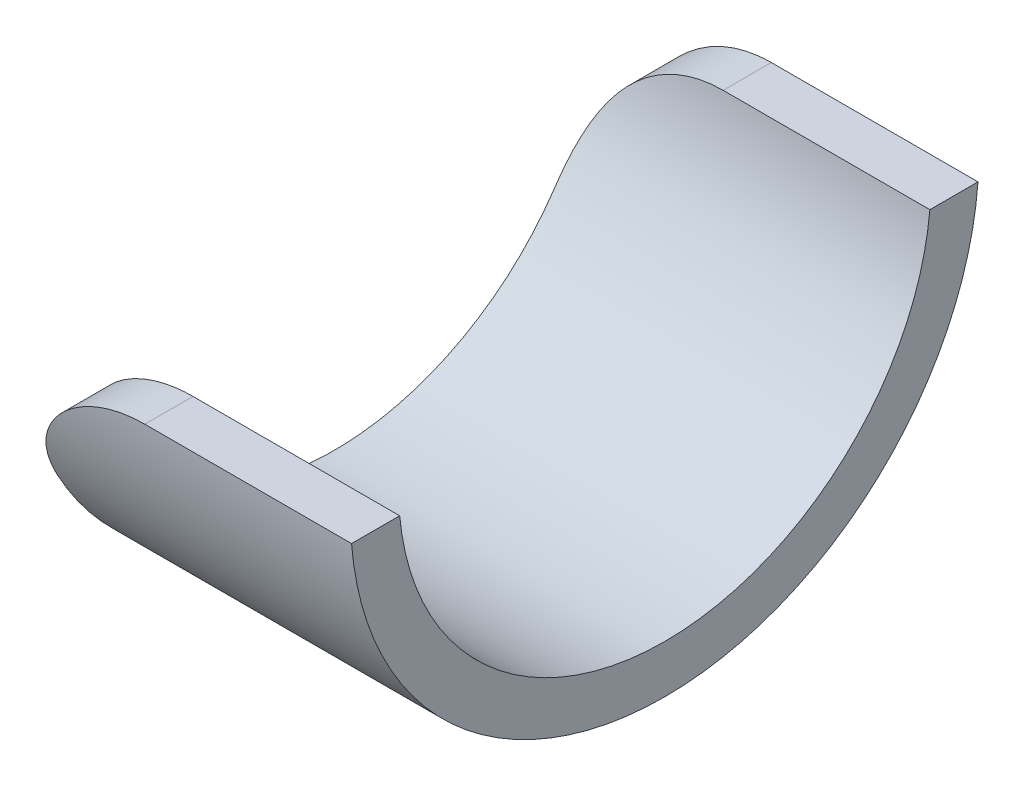
ISO-10303-21;
HEADER;
FILE_DESCRIPTION(('STEP AP214'),'2;1');
FILE_NAME('part.step','',(''),(''),'','','');
FILE_SCHEMA(('AUTOMOTIVE_DESIGN { 1 0 10303 214 1 1 1 1 }'));
ENDSEC;
DATA;
#1=APPLICATION_CONTEXT('core data for automotive mechanical design processes');
#2=APPLICATION_PROTOCOL_DEFINITION('international standard','automotive_design',2000,#1);
#3=PRODUCT_CONTEXT('',#1,'mechanical');
#4=PRODUCT('Part','Part','',(#3));
#5=PRODUCT_RELATED_PRODUCT_CATEGORY('part','',(#4));
#6=PRODUCT_DEFINITION_FORMATION('','',#4);
#7=PRODUCT_DEFINITION_CONTEXT('part definition',#1,'design');
#8=PRODUCT_DEFINITION('design','',#6,#7);
#9=PRODUCT_DEFINITION_SHAPE('','',#8);
#10=(LENGTH_UNIT() NAMED_UNIT(*) SI_UNIT(.MILLI.,.METRE.));
#11=(NAMED_UNIT(*) PLANE_ANGLE_UNIT() SI_UNIT($,.RADIAN.));
#12=(NAMED_UNIT(*) SI_UNIT($,.STERADIAN.) SOLID_ANGLE_UNIT());
#13=UNCERTAINTY_MEASURE_WITH_UNIT(LENGTH_MEASURE(1.E-05),#10,'distance_accuracy_value','');
#14=(GEOMETRIC_REPRESENTATION_CONTEXT(3) GLOBAL_UNCERTAINTY_ASSIGNED_CONTEXT((#13)) GLOBAL_UNIT_ASSIGNED_CONTEXT((#10,
#11,#12)) REPRESENTATION_CONTEXT('',''));
#15=CARTESIAN_POINT('',(0.,0.,0.));
#16=DIRECTION('',(0.,0.,1.));
#17=DIRECTION('',(1.,0.,0.));
#18=AXIS2_PLACEMENT_3D('',#15,#16,#17);
#19=CARTESIAN_POINT('',(25.4,0.,0.));
#20=DIRECTION('',(-1.,0.,0.));
#21=DIRECTION('',(0.,0.,1.));
#22=AXIS2_PLACEMENT_3D('',#19,#20,#21);
#23=CYLINDRICAL_SURFACE('',#22,24.13);
#24=CARTESIAN_POINT('',(0.,0.,0.));
#25=DIRECTION('',(1.,0.,0.));
#26=DIRECTION('',(0.,0.,-1.));
#27=AXIS2_PLACEMENT_3D('',#24,#25,#26);
#28=CIRCLE('',#27,24.13);
#29=CARTESIAN_POINT('',(0.,-11.43,21.2511646739655));
#30=VERTEX_POINT('',#29);
#31=CARTESIAN_POINT('',(0.,-11.43,-21.2511646739655));
#32=VERTEX_POINT('',#31);
#33=EDGE_CURVE('E164',#30,#32,#28,.T.);
#34=ORIENTED_EDGE('',*,*,#33,.T.);
#35=CARTESIAN_POINT('',(0.,-11.43,-21.2511646739655));
#36=CARTESIAN_POINT('',(-2.62243007126413E-05,-11.1860224640543,-21.3824335393108));
#37=CARTESIAN_POINT('',(0.00937477308694025,-10.9396845502003,-21.5094658719944));
#38=CARTESIAN_POINT('',(0.0479236395877504,-10.4439055163118,-21.7544876609394));
#39=CARTESIAN_POINT('',(0.0770830725086785,-10.1944626630503,-21.8724717766096));
#40=CARTESIAN_POINT('',(0.156118837118842,-9.69390311880306,-22.0988883031836));
#41=CARTESIAN_POINT('',(0.206034677985443,-9.44278413916173,-22.2073020174487));
#42=CARTESIAN_POINT('',(0.327202368802155,-8.94150477192952,-22.4138311063666));
#43=CARTESIAN_POINT('',(0.398449861662112,-8.69134419913753,-22.5119485785534));
#44=CARTESIAN_POINT('',(0.562964102877934,-8.19324315777415,-22.6979873973509));
#45=CARTESIAN_POINT('',(0.656316560719896,-7.94531533145705,-22.7858670176028));
#46=CARTESIAN_POINT('',(0.864917743170024,-7.45513554205446,-22.9509202864259));
#47=CARTESIAN_POINT('',(0.980168085088761,-7.21288399968737,-23.0280931434996));
#48=CARTESIAN_POINT('',(1.23201910546764,-6.73697795539725,-23.1717872843801));
#49=CARTESIAN_POINT('',(1.36858542185224,-6.50331035205277,-23.238325368346));
#50=CARTESIAN_POINT('',(1.66250238886438,-6.04664831564512,-23.3613112980713));
#51=CARTESIAN_POINT('',(1.81985155894157,-5.82365312382992,-23.4177598619249));
#52=CARTESIAN_POINT('',(2.14347109553134,-5.40470991060296,-23.5178520749754));
#53=CARTESIAN_POINT('',(2.3085037041298,-5.20794553211169,-23.562088255933));
#54=CARTESIAN_POINT('',(2.65479050631666,-4.82757709066209,-23.6429526368408));
#55=CARTESIAN_POINT('',(2.83604409448118,-4.64397253699317,-23.6795811205675));
#56=CARTESIAN_POINT('',(3.21363852043108,-4.29143598197451,-23.7460034791518));
#57=CARTESIAN_POINT('',(3.40998739998141,-4.12251190492314,-23.7757936768714));
#58=CARTESIAN_POINT('',(3.81630838261891,-3.80087139049984,-23.8293278664702));
#59=CARTESIAN_POINT('',(4.02628051460483,-3.64815498751076,-23.8530718455232));
#60=CARTESIAN_POINT('',(4.45704285565434,-3.36104542848596,-23.895213047223));
#61=CARTESIAN_POINT('',(4.67775947309696,-3.22654644377813,-23.9136419215247));
#62=CARTESIAN_POINT('',(5.12964311440567,-2.97581587645182,-23.9461355713094));
#63=CARTESIAN_POINT('',(5.36081023917931,-2.85958447026916,-23.960200304643));
#64=CARTESIAN_POINT('',(5.831928095831,-2.64628232956131,-23.9846954693647));
#65=CARTESIAN_POINT('',(6.07187653555342,-2.54920663658397,-23.9951268417838));
#66=CARTESIAN_POINT('',(6.55895637291033,-2.37488541721316,-24.0130070257699));
#67=CARTESIAN_POINT('',(6.80608684064031,-2.29763733623003,-24.0204562216298));
#68=CARTESIAN_POINT('',(7.25703859547032,-2.17660389124137,-24.0316919659944));
#69=CARTESIAN_POINT('',(7.45989511606065,-2.12922984902613,-24.0359096588211));
#70=CARTESIAN_POINT('',(7.86827969905803,-2.04787644322711,-24.0429774229925));
#71=CARTESIAN_POINT('',(8.07380739515986,-2.0138952626542,-24.0458276798666));
#72=CARTESIAN_POINT('',(8.48648285909893,-1.95949981658252,-24.0503232209338));
#73=CARTESIAN_POINT('',(8.69362909932989,-1.93907402968682,-24.0519695285443));
#74=CARTESIAN_POINT('',(9.10884950593469,-1.9118178800914,-24.0541447550348));
#75=CARTESIAN_POINT('',(9.31692380045259,-1.90498945704754,-24.0546735144979));
#76=CARTESIAN_POINT('',(9.525,-1.905,-24.0546850945923));
#77=B_SPLINE_CURVE_WITH_KNOTS('',3,(#35,#36,#37,#38,#39,#40,#41,#42,#43,#44,#45,#46,#47,#48,#49,
#50,#51,#52,#53,#54,#55,#56,#57,#58,#59,#60,#61,#62,#63,#64,#65,#66,#67,#68,#69,#70,#71,#72,#73,
#74,#75,#76),.UNSPECIFIED.,.F.,.F.,(4,2,2,2,2,2,2,2,2,2,2,2,2,2,2,2,2,2,2,2,4),(0.,
0.831053790770307,1.66259438406464,2.49572508742816,3.32868573588827,4.16493056434458,
5.0012371793046,5.83620930417523,6.67112197849129,7.45196225401338,8.23277339798149,
9.01400342752858,9.79523511433871,10.5717136526312,11.3481996900133,12.1244844697337,
12.9006691826562,13.5253091224103,14.1498642890198,14.7738879332271,15.3980005876607),.UNSPECIFIED.);
#78=CARTESIAN_POINT('',(9.525,-1.905,-24.0546850945923));
#79=VERTEX_POINT('',#78);
#80=EDGE_CURVE('E42',#32,#79,#77,.T.);
#81=ORIENTED_EDGE('',*,*,#80,.T.);
#82=DIRECTION('',(-1.,0.,0.));
#83=VECTOR('',#82,1.);
#84=CARTESIAN_POINT('',(25.4,-1.905,-24.0546850945923));
#85=LINE('',#84,#83);
#86=CARTESIAN_POINT('',(25.4,-1.905,-24.0546850945923));
#87=VERTEX_POINT('',#86);
#88=EDGE_CURVE('E94',#87,#79,#85,.T.);
#89=ORIENTED_EDGE('',*,*,#88,.F.);
#90=CARTESIAN_POINT('',(25.4,0.,0.));
#91=DIRECTION('',(1.,0.,0.));
#92=DIRECTION('',(0.,0.,-1.));
#93=AXIS2_PLACEMENT_3D('',#90,#91,#92);
#94=CIRCLE('',#93,24.13);
#95=CARTESIAN_POINT('',(25.4,-1.905,24.0546850945923));
#96=VERTEX_POINT('',#95);
#97=EDGE_CURVE('E101',#96,#87,#94,.T.);
#98=ORIENTED_EDGE('',*,*,#97,.F.);
#99=DIRECTION('',(-1.,0.,0.));
#100=VECTOR('',#99,1.);
#101=CARTESIAN_POINT('',(25.4,-1.905,24.0546850945923));
#102=LINE('',#101,#100);
#103=CARTESIAN_POINT('',(9.525,-1.905,24.0546850945923));
#104=VERTEX_POINT('',#103);
#105=EDGE_CURVE('E183',#96,#104,#102,.T.);
#106=ORIENTED_EDGE('',*,*,#105,.T.);
#107=CARTESIAN_POINT('',(9.525,-1.905,24.0546850945923));
#108=CARTESIAN_POINT('',(9.25902855860662,-1.90497112249098,24.0546543706783));
#109=CARTESIAN_POINT('',(8.99305996792605,-1.91613908815105,24.0538018907344));
#110=CARTESIAN_POINT('',(8.46300387273561,-1.9606612994031,24.0502314004206));
#111=CARTESIAN_POINT('',(8.1989163303127,-1.99401509654734,24.0475134277582));
#112=CARTESIAN_POINT('',(7.67456650786336,-2.08268810274374,24.0399910936523));
#113=CARTESIAN_POINT('',(7.41430308962371,-2.1380006327919,24.0351873665735));
#114=CARTESIAN_POINT('',(6.89937138401652,-2.2701777631287,24.0230644040504));
#115=CARTESIAN_POINT('',(6.6447029998715,-2.34704199031998,24.0157452121526));
#116=CARTESIAN_POINT('',(6.14260206552165,-2.52181707329971,23.9980216823762));
#117=CARTESIAN_POINT('',(5.89517469334633,-2.61974259140439,23.9876151932781));
#118=CARTESIAN_POINT('',(5.40953230749561,-2.83586324053376,23.9630257307452));
#119=CARTESIAN_POINT('',(5.17131717562001,-2.9540581113811,23.9488428057835));
#120=CARTESIAN_POINT('',(4.70588661033124,-3.20976539159897,23.9159133288637));
#121=CARTESIAN_POINT('',(4.47866874681592,-3.34727350681213,23.8971677906916));
#122=CARTESIAN_POINT('',(4.03685190596719,-3.64051036300694,23.8542560267361));
#123=CARTESIAN_POINT('',(3.82225273297257,-3.79623882135804,23.8300898850306));
#124=CARTESIAN_POINT('',(3.40913310360506,-4.12311644738061,23.7757019327644));
#125=CARTESIAN_POINT('',(3.21048485846543,-4.29411352349554,23.7455368268045));
#126=CARTESIAN_POINT('',(2.82856447170116,-4.65123007876344,23.6781748356056));
#127=CARTESIAN_POINT('',(2.64529225956836,-4.8373494885639,23.6409779826139));
#128=CARTESIAN_POINT('',(2.29548581756171,-5.22294907941939,23.5587888909164));
#129=CARTESIAN_POINT('',(2.12894399446347,-5.42242313023072,23.5138002140805));
#130=CARTESIAN_POINT('',(1.81359856584554,-5.83295582002549,23.4153383321293));
#131=CARTESIAN_POINT('',(1.6647945124326,-6.04401416629933,23.3618653413296));
#132=CARTESIAN_POINT('',(1.38874855215797,-6.47113711214399,23.2471317644862));
#133=CARTESIAN_POINT('',(1.26111596507832,-6.68700031712436,23.1860605993367));
#134=CARTESIAN_POINT('',(1.02423098390503,-7.12596104699,23.0549352631465));
#135=CARTESIAN_POINT('',(0.914978750332491,-7.34905863503499,22.9848810136632));
#136=CARTESIAN_POINT('',(0.715071957252479,-7.80069709441672,22.8355565811858));
#137=CARTESIAN_POINT('',(0.624434549431874,-8.02924277118396,22.7562780033086));
#138=CARTESIAN_POINT('',(0.461930113313286,-8.48959759740636,22.5885730040502));
#139=CARTESIAN_POINT('',(0.390061506300686,-8.72140647065202,22.5001473529379));
#140=CARTESIAN_POINT('',(0.271603413772416,-9.16141574281794,22.3243212812767));
#141=CARTESIAN_POINT('',(0.223127464472969,-9.36947657204716,22.2378315842086));
#142=CARTESIAN_POINT('',(0.140643449883782,-9.7854805725289,22.0579381550127));
#143=CARTESIAN_POINT('',(0.106635777848727,-9.99342374042991,21.9645342350342));
#144=CARTESIAN_POINT('',(0.0527401220690146,-10.4075477143405,21.771354509249));
#145=CARTESIAN_POINT('',(0.0328187663108996,-10.6137315346706,21.6715943779708));
#146=CARTESIAN_POINT('',(0.00644491721495352,-11.0238100019182,21.4659113001518));
#147=CARTESIAN_POINT('',(-1.12453408408947E-05,-11.2277052573949,21.3599900405856));
#148=CARTESIAN_POINT('',(0.,-11.43,21.2511646739655));
#149=B_SPLINE_CURVE_WITH_KNOTS('',3,(#107,#108,#109,#110,#111,#112,#113,#114,#115,#116,#117,
#118,#119,#120,#121,#122,#123,#124,#125,#126,#127,#128,#129,#130,#131,#132,#133,#134,#135,#136,
#137,#138,#139,#140,#141,#142,#143,#144,#145,#146,#147,#148),.UNSPECIFIED.,.F.,.F.,(4,2,2,2,2,2,
2,2,2,2,2,2,2,2,2,2,2,2,2,2,4),(0.,0.797674807200183,1.59533349129078,2.39274974387176,
3.19015219264293,3.98811157936095,4.78606072424157,5.58383273105668,6.38159236462163,
7.17214191497642,7.96268783999794,8.75287333268876,9.54303886831846,10.316430031771,
11.0898279491281,11.8639353089751,12.6379775347455,13.3288503903548,14.0197420230188,
14.7089913240004,15.3980527824104),.UNSPECIFIED.);
#150=EDGE_CURVE('E49',#104,#30,#149,.T.);
#151=ORIENTED_EDGE('',*,*,#150,.T.);
#152=EDGE_LOOP('',(#34,#81,#89,#98,#106,#151));
#153=FACE_BOUND('',#152,.T.);
#154=ADVANCED_FACE('F33',(#153),#23,.T.);
#155=CARTESIAN_POINT('',(25.4,-1.905,-20.3580643480661));
#156=DIRECTION('',(0.,-1.,0.));
#157=DIRECTION('',(0.,0.,-1.));
#158=AXIS2_PLACEMENT_3D('',#155,#156,#157);
#159=PLANE('',#158);
#160=ORIENTED_EDGE('',*,*,#88,.T.);
#161=DIRECTION('',(0.,0.,1.));
#162=VECTOR('',#161,1.);
#163=CARTESIAN_POINT('',(9.525,-1.905,-20.3580643480661));
#164=LINE('',#163,#162);
#165=CARTESIAN_POINT('',(9.525,-1.905,-20.3580643480661));
#166=VERTEX_POINT('',#165);
#167=EDGE_CURVE('E113',#79,#166,#164,.T.);
#168=ORIENTED_EDGE('',*,*,#167,.T.);
#169=DIRECTION('',(-1.,0.,0.));
#170=VECTOR('',#169,1.);
#171=CARTESIAN_POINT('',(25.4,-1.905,-20.3580643480661));
#172=LINE('',#171,#170);
#173=CARTESIAN_POINT('',(25.4,-1.905,-20.3580643480661));
#174=VERTEX_POINT('',#173);
#175=EDGE_CURVE('E97',#174,#166,#172,.T.);
#176=ORIENTED_EDGE('',*,*,#175,.F.);
#177=DIRECTION('',(0.,0.,1.));
#178=VECTOR('',#177,1.);
#179=CARTESIAN_POINT('',(25.4,-1.905,-20.3580643480661));
#180=LINE('',#179,#178);
#181=EDGE_CURVE('E89',#87,#174,#180,.T.);
#182=ORIENTED_EDGE('',*,*,#181,.F.);
#183=EDGE_LOOP('',(#160,#168,#176,#182));
#184=FACE_BOUND('',#183,.T.);
#185=ADVANCED_FACE('F91',(#184),#159,.F.);
#186=CARTESIAN_POINT('',(25.4,0.,0.));
#187=DIRECTION('',(-1.,0.,0.));
#188=DIRECTION('',(0.,0.,1.));
#189=AXIS2_PLACEMENT_3D('',#186,#187,#188);
#190=CYLINDRICAL_SURFACE('',#189,20.447);
#191=ORIENTED_EDGE('',*,*,#175,.T.);
#192=CARTESIAN_POINT('',(9.525,-1.905,-20.3580643480661));
#193=CARTESIAN_POINT('',(9.25978977014526,-1.90497110377044,-20.3580283743182));
#194=CARTESIAN_POINT('',(8.99458190205295,-1.91607541741178,-20.3570267347558));
#195=CARTESIAN_POINT('',(8.46603330595991,-1.96034336128463,-20.352832188804));
#196=CARTESIAN_POINT('',(8.20269256023756,-1.99350678186011,-20.3496393032408));
#197=CARTESIAN_POINT('',(7.67976710818044,-2.08168051639916,-20.3408028731761));
#198=CARTESIAN_POINT('',(7.42018195184562,-2.13668819010333,-20.3351596248361));
#199=CARTESIAN_POINT('',(6.9065823565463,-2.26813517562933,-20.3209194671558));
#200=CARTESIAN_POINT('',(6.65256781040154,-2.34457407471702,-20.312322614697));
#201=CARTESIAN_POINT('',(6.15172905872527,-2.51837915517059,-20.2915062917797));
#202=CARTESIAN_POINT('',(5.90491062304745,-2.61576163208616,-20.2792839976529));
#203=CARTESIAN_POINT('',(5.42046974204375,-2.83065885374987,-20.2504056126832));
#204=CARTESIAN_POINT('',(5.18284713201861,-2.94817323772638,-20.2337496012912));
#205=CARTESIAN_POINT('',(4.71860313323052,-3.20235227155138,-20.1950801117434));
#206=CARTESIAN_POINT('',(4.49197903223694,-3.33901216747872,-20.1730679625452));
#207=CARTESIAN_POINT('',(4.05136405145136,-3.63034088398203,-20.1226806227278));
#208=CARTESIAN_POINT('',(3.83737292244127,-3.78500934911329,-20.0943055576867));
#209=CARTESIAN_POINT('',(3.42620891630364,-4.10893379759801,-20.030560824482));
#210=CARTESIAN_POINT('',(3.22885954487623,-4.27798374878302,-19.9952828225731));
#211=CARTESIAN_POINT('',(2.84947281277147,-4.63073177356297,-19.9165452957226));
#212=CARTESIAN_POINT('',(2.66743532964771,-4.81442972999756,-19.8730858362156));
#213=CARTESIAN_POINT('',(2.32005992918782,-5.19456017598146,-19.7771267369428));
#214=CARTESIAN_POINT('',(2.15471065709082,-5.39098385541035,-19.724633310632));
#215=CARTESIAN_POINT('',(1.84162833815016,-5.79469430757571,-19.6098279166227));
#216=CARTESIAN_POINT('',(1.69389475833076,-6.00198075137795,-19.5475162461149));
#217=CARTESIAN_POINT('',(1.42089667288137,-6.41906899364777,-19.4144755131979));
#218=CARTESIAN_POINT('',(1.29510049382968,-6.62861897179975,-19.3440467118341));
#219=CARTESIAN_POINT('',(1.06130049022161,-7.05389488573657,-19.1930529525103));
#220=CARTESIAN_POINT('',(0.953296570547871,-7.26962078849771,-19.112488048742));
#221=CARTESIAN_POINT('',(0.755103699314461,-7.70549373801177,-18.9409635820805));
#222=CARTESIAN_POINT('',(0.664940401084745,-7.92564665685008,-18.8499893436497));
#223=CARTESIAN_POINT('',(0.50249570259122,-8.36804475355946,-18.6578079286869));
#224=CARTESIAN_POINT('',(0.430213517538051,-8.59028983916225,-18.5566012015262));
#225=CARTESIAN_POINT('',(0.303153739250019,-9.03487826701944,-18.3442481822495));
#226=CARTESIAN_POINT('',(0.248367946006984,-9.25722151419619,-18.23310657765));
#227=CARTESIAN_POINT('',(0.155607328845854,-9.70043791104361,-18.0012194838147));
#228=CARTESIAN_POINT('',(0.117635672778708,-9.92131077597413,-17.8804721898794));
#229=CARTESIAN_POINT('',(0.057778548534097,-10.3594428106769,-17.6302342348168));
#230=CARTESIAN_POINT('',(0.0358505781251143,-10.5767100272518,-17.5007676745597));
#231=CARTESIAN_POINT('',(0.00695864841239081,-11.0068892110165,-17.2334730625406));
#232=CARTESIAN_POINT('',(-1.40946185446643E-05,-11.2198036619075,-17.0956499678064));
#233=CARTESIAN_POINT('',(0.,-11.43,-16.9539054202859));
#234=B_SPLINE_CURVE_WITH_KNOTS('',3,(#192,#193,#194,#195,#196,#197,#198,#199,#200,#201,#202,
#203,#204,#205,#206,#207,#208,#209,#210,#211,#212,#213,#214,#215,#216,#217,#218,#219,#220,#221,
#222,#223,#224,#225,#226,#227,#228,#229,#230,#231,#232,#233),.UNSPECIFIED.,.F.,.F.,(4,2,2,2,2,2,
2,2,2,2,2,2,2,2,2,2,2,2,2,2,4),(0.,0.795393423654686,1.59077928777243,2.38606904486716,
3.18134348689319,3.97723896055609,4.77312017295292,5.5688041133931,6.3644723516572,
7.15021538340832,7.93595213111672,8.72115060258975,9.5063253112738,10.2684854549721,
11.0306415240326,11.7938856708571,12.5570963134924,13.319948736603,14.082944823085,
14.8439122217054,15.604432555074),.UNSPECIFIED.);
#235=CARTESIAN_POINT('',(0.,-11.43,-16.9539054202859));
#236=VERTEX_POINT('',#235);
#237=EDGE_CURVE('E127',#166,#236,#234,.T.);
#238=ORIENTED_EDGE('',*,*,#237,.T.);
#239=CARTESIAN_POINT('',(0.,0.,0.));
#240=DIRECTION('',(-1.,0.,0.));
#241=DIRECTION('',(0.,0.,-1.));
#242=AXIS2_PLACEMENT_3D('',#239,#240,#241);
#243=CIRCLE('',#242,20.447);
#244=CARTESIAN_POINT('',(0.,-11.43,16.9539054202859));
#245=VERTEX_POINT('',#244);
#246=EDGE_CURVE('E110',#236,#245,#243,.T.);
#247=ORIENTED_EDGE('',*,*,#246,.T.);
#248=CARTESIAN_POINT('',(0.,-11.43,16.9539054202859));
#249=CARTESIAN_POINT('',(-2.26556267190623E-05,-11.1970109347333,17.1110348965797));
#250=CARTESIAN_POINT('',(0.00854996527283876,-10.9606584924522,17.2633409521735));
#251=CARTESIAN_POINT('',(0.0441943253259937,-10.4827345096676,17.557631634213));
#252=CARTESIAN_POINT('',(0.0712805745076498,-10.241159019522,17.6996080681937));
#253=CARTESIAN_POINT('',(0.145377805371788,-9.75392492005596,17.9727321356884));
#254=CARTESIAN_POINT('',(0.192449364536353,-9.50825609668595,18.1038453856936));
#255=CARTESIAN_POINT('',(0.307566450309029,-9.01577956315671,18.3540664977231));
#256=CARTESIAN_POINT('',(0.375606449191654,-8.76897217001962,18.4731775128226));
#257=CARTESIAN_POINT('',(0.53383245903843,-8.27531248509759,18.6995490297245));
#258=CARTESIAN_POINT('',(0.624131647136172,-8.02846661678016,18.8067447749873));
#259=CARTESIAN_POINT('',(0.827078092665168,-7.53872313086899,19.0083559040058));
#260=CARTESIAN_POINT('',(0.939727382262767,-7.29582587447428,19.1027701242966));
#261=CARTESIAN_POINT('',(1.18702756275254,-6.81738744881128,19.2786895398164));
#262=CARTESIAN_POINT('',(1.32162936657595,-6.58183123312698,19.3602227547461));
#263=CARTESIAN_POINT('',(1.61248686004771,-6.12037421258529,19.5110161349573));
#264=CARTESIAN_POINT('',(1.76874040418349,-5.89447245394763,19.580277514731));
#265=CARTESIAN_POINT('',(2.08719310004087,-5.47451213954638,19.7015990829017));
#266=CARTESIAN_POINT('',(2.24764088450731,-5.27940511020473,19.7546393047696));
#267=CARTESIAN_POINT('',(2.58476100175011,-4.90138340496377,19.8518094278578));
#268=CARTESIAN_POINT('',(2.76143244282964,-4.71846805992848,19.8959398183609));
#269=CARTESIAN_POINT('',(3.12994468473486,-4.36644050139834,19.976151579886));
#270=CARTESIAN_POINT('',(3.32179551996768,-4.19733757130689,20.0122275652699));
#271=CARTESIAN_POINT('',(3.7192248194697,-3.87459604014138,20.0772114901172));
#272=CARTESIAN_POINT('',(3.92480339005321,-3.72095755885468,20.1061193740592));
#273=CARTESIAN_POINT('',(4.34587685286661,-3.43207667548693,20.1574291495039));
#274=CARTESIAN_POINT('',(4.56123652101523,-3.29664918935762,20.1798996243166));
#275=CARTESIAN_POINT('',(5.00256224098035,-3.04322714023593,20.2196697315629));
#276=CARTESIAN_POINT('',(5.22853303698627,-2.92524047465008,20.2369670251252));
#277=CARTESIAN_POINT('',(5.68939336395446,-2.7076913191788,20.2672218373143));
#278=CARTESIAN_POINT('',(5.92428109734117,-2.6081251394077,20.2801802255078));
#279=CARTESIAN_POINT('',(6.40133118829256,-2.42815162760385,20.3025150068543));
#280=CARTESIAN_POINT('',(6.64349011485936,-2.34773541457401,20.3118930616464));
#281=CARTESIAN_POINT('',(7.10242990400114,-2.21553591633533,20.3267077281063));
#282=CARTESIAN_POINT('',(7.31852976669072,-2.16141368417318,20.3324935680789));
#283=CARTESIAN_POINT('',(7.75401731871972,-2.06843955546321,20.3421616557291));
#284=CARTESIAN_POINT('',(7.97340471224863,-2.02958629348418,20.3460440736285));
#285=CARTESIAN_POINT('',(8.41426514810789,-1.96736786921801,20.352157279265));
#286=CARTESIAN_POINT('',(8.63573700720965,-1.94399440122065,20.3543889527872));
#287=CARTESIAN_POINT('',(9.0798052484316,-1.91280264393239,20.3573335916408));
#288=CARTESIAN_POINT('',(9.30240173911299,-1.9049858862538,20.358046407436));
#289=CARTESIAN_POINT('',(9.525,-1.905,20.3580643480661));
#290=B_SPLINE_CURVE_WITH_KNOTS('',3,(#248,#249,#250,#251,#252,#253,#254,#255,#256,#257,#258,
#259,#260,#261,#262,#263,#264,#265,#266,#267,#268,#269,#270,#271,#272,#273,#274,#275,#276,#277,
#278,#279,#280,#281,#282,#283,#284,#285,#286,#287,#288,#289),.UNSPECIFIED.,.F.,.F.,(4,2,2,2,2,2,
2,2,2,2,2,2,2,2,2,2,2,2,2,2,4),(0.,0.843012231859918,1.68668593203055,2.53293535688566,
3.37896188300092,4.22938213047316,5.07987973723859,5.92850102018458,6.77703827167067,
7.55044553476625,8.32381031468301,9.09769067222045,9.87157702376157,10.6368826673749,
11.4025337956783,12.1680313867012,12.9331732758271,13.6011795842373,14.2691261424273,
14.9367140217581,15.6043676241904),.UNSPECIFIED.);
#291=CARTESIAN_POINT('',(9.525,-1.905,20.3580643480661));
#292=VERTEX_POINT('',#291);
#293=EDGE_CURVE('E115',#245,#292,#290,.T.);
#294=ORIENTED_EDGE('',*,*,#293,.T.);
#295=DIRECTION('',(-1.,0.,0.));
#296=VECTOR('',#295,1.);
#297=CARTESIAN_POINT('',(25.4,-1.905,20.3580643480661));
#298=LINE('',#297,#296);
#299=CARTESIAN_POINT('',(25.4,-1.905,20.3580643480661));
#300=VERTEX_POINT('',#299);
#301=EDGE_CURVE('E117',#300,#292,#298,.T.);
#302=ORIENTED_EDGE('',*,*,#301,.F.);
#303=CARTESIAN_POINT('',(25.4,0.,0.));
#304=DIRECTION('',(-1.,0.,0.));
#305=DIRECTION('',(0.,0.,-1.));
#306=AXIS2_PLACEMENT_3D('',#303,#304,#305);
#307=CIRCLE('',#306,20.447);
#308=EDGE_CURVE('E100',#174,#300,#307,.T.);
#309=ORIENTED_EDGE('',*,*,#308,.F.);
#310=EDGE_LOOP('',(#191,#238,#247,#294,#302,#309));
#311=FACE_BOUND('',#310,.T.);
#312=ADVANCED_FACE('F133',(#311),#190,.F.);
#313=CARTESIAN_POINT('',(25.4,-1.905,24.0546850945923));
#314=DIRECTION('',(0.,-1.,0.));
#315=DIRECTION('',(0.,0.,-1.));
#316=AXIS2_PLACEMENT_3D('',#313,#314,#315);
#317=PLANE('',#316);
#318=ORIENTED_EDGE('',*,*,#301,.T.);
#319=DIRECTION('',(0.,0.,1.));
#320=VECTOR('',#319,1.);
#321=CARTESIAN_POINT('',(9.525,-1.905,24.0546850945923));
#322=LINE('',#321,#320);
#323=EDGE_CURVE('E11',#292,#104,#322,.T.);
#324=ORIENTED_EDGE('',*,*,#323,.T.);
#325=ORIENTED_EDGE('',*,*,#105,.F.);
#326=DIRECTION('',(0.,0.,1.));
#327=VECTOR('',#326,1.);
#328=CARTESIAN_POINT('',(25.4,-1.905,24.0546850945923));
#329=LINE('',#328,#327);
#330=EDGE_CURVE('E106',#300,#96,#329,.T.);
#331=ORIENTED_EDGE('',*,*,#330,.F.);
#332=EDGE_LOOP('',(#318,#324,#325,#331));
#333=FACE_BOUND('',#332,.T.);
#334=ADVANCED_FACE('F138',(#333),#317,.F.);
#335=CARTESIAN_POINT('',(25.4,0.,0.));
#336=DIRECTION('',(1.,0.,0.));
#337=DIRECTION('',(0.,0.,-1.));
#338=AXIS2_PLACEMENT_3D('',#335,#336,#337);
#339=PLANE('',#338);
#340=ORIENTED_EDGE('',*,*,#97,.T.);
#341=ORIENTED_EDGE('',*,*,#181,.T.);
#342=ORIENTED_EDGE('',*,*,#308,.T.);
#343=ORIENTED_EDGE('',*,*,#330,.T.);
#344=EDGE_LOOP('',(#340,#341,#342,#343));
#345=FACE_BOUND('',#344,.T.);
#346=ADVANCED_FACE('F104',(#345),#339,.T.);
#347=CARTESIAN_POINT('',(0.,0.,0.));
#348=DIRECTION('',(1.,0.,0.));
#349=DIRECTION('',(0.,0.,-1.));
#350=AXIS2_PLACEMENT_3D('',#347,#348,#349);
#351=PLANE('',#350);
#352=ORIENTED_EDGE('',*,*,#246,.F.);
#353=DIRECTION('',(0.,0.,1.));
#354=VECTOR('',#353,1.);
#355=CARTESIAN_POINT('',(0.,-11.43,0.));
#356=LINE('',#355,#354);
#357=EDGE_CURVE('E56',#236,#32,#356,.F.);
#358=ORIENTED_EDGE('',*,*,#357,.T.);
#359=ORIENTED_EDGE('',*,*,#33,.F.);
#360=DIRECTION('',(0.,0.,1.));
#361=VECTOR('',#360,1.);
#362=CARTESIAN_POINT('',(0.,-11.43,0.));
#363=LINE('',#362,#361);
#364=EDGE_CURVE('E159',#30,#245,#363,.F.);
#365=ORIENTED_EDGE('',*,*,#364,.T.);
#366=EDGE_LOOP('',(#352,#358,#359,#365));
#367=FACE_BOUND('',#366,.T.);
#368=ADVANCED_FACE('F163',(#367),#351,.F.);
#369=CARTESIAN_POINT('',(9.525,-11.43,-20.3580643480661));
#370=DIRECTION('',(0.,0.,1.));
#371=DIRECTION('',(1.,0.,0.));
#372=AXIS2_PLACEMENT_3D('',#369,#370,#371);
#373=CYLINDRICAL_SURFACE('',#372,9.525);
#374=ORIENTED_EDGE('',*,*,#80,.F.);
#375=ORIENTED_EDGE('',*,*,#357,.F.);
#376=ORIENTED_EDGE('',*,*,#237,.F.);
#377=ORIENTED_EDGE('',*,*,#167,.F.);
#378=EDGE_LOOP('',(#374,#375,#376,#377));
#379=FACE_BOUND('',#378,.T.);
#380=ADVANCED_FACE('F146',(#379),#373,.T.);
#381=CARTESIAN_POINT('',(9.525,-11.43,24.0546850945923));
#382=DIRECTION('',(0.,0.,1.));
#383=DIRECTION('',(1.,0.,0.));
#384=AXIS2_PLACEMENT_3D('',#381,#382,#383);
#385=CYLINDRICAL_SURFACE('',#384,9.525);
#386=ORIENTED_EDGE('',*,*,#293,.F.);
#387=ORIENTED_EDGE('',*,*,#364,.F.);
#388=ORIENTED_EDGE('',*,*,#150,.F.);
#389=ORIENTED_EDGE('',*,*,#323,.F.);
#390=EDGE_LOOP('',(#386,#387,#388,#389));
#391=FACE_BOUND('',#390,.T.);
#392=ADVANCED_FACE('F35',(#391),#385,.T.);
#393=CLOSED_SHELL('',(#154,#185,#312,#334,#346,#368,#380,#392));
#394=MANIFOLD_SOLID_BREP('B2',#393);
#395=ADVANCED_BREP_SHAPE_REPRESENTATION('',(#18,#394),#14);
#396=SHAPE_DEFINITION_REPRESENTATION(#9,#395);
ENDSEC;
END-ISO-10303-21;
